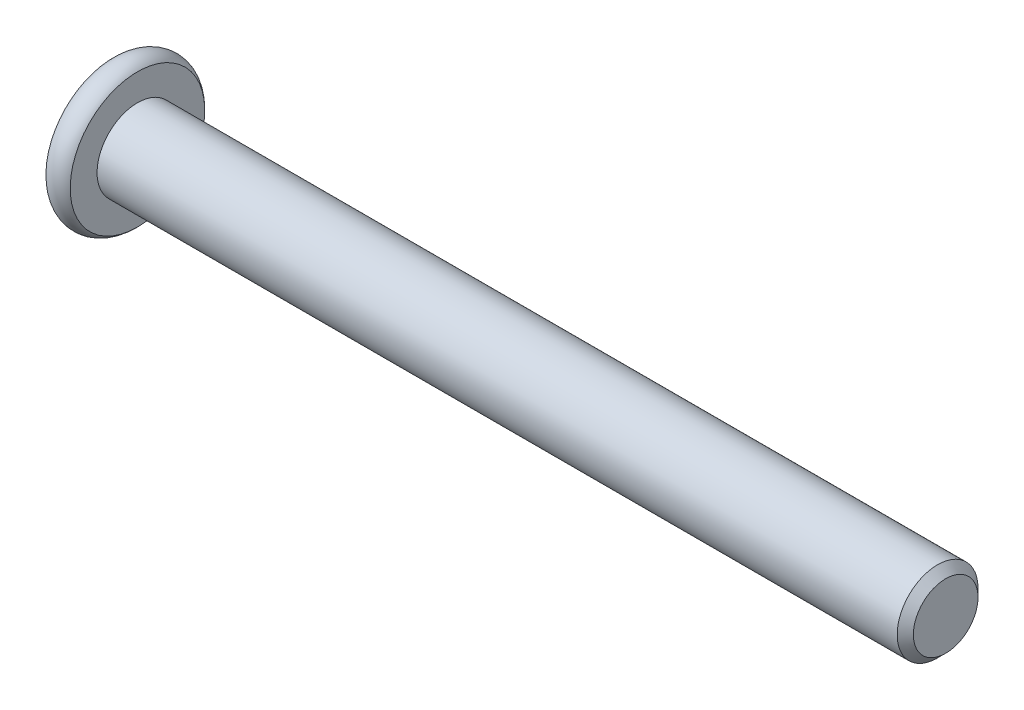
ISO-10303-21;
HEADER;
FILE_DESCRIPTION(('STEP AP214'),'2;1');
FILE_NAME('part.step','',(''),(''),'','','');
FILE_SCHEMA(('AUTOMOTIVE_DESIGN { 1 0 10303 214 1 1 1 1 }'));
ENDSEC;
DATA;
#1=APPLICATION_CONTEXT('core data for automotive mechanical design processes');
#2=APPLICATION_PROTOCOL_DEFINITION('international standard','automotive_design',2000,#1);
#3=PRODUCT_CONTEXT('',#1,'mechanical');
#4=PRODUCT('Part','Part','',(#3));
#5=PRODUCT_RELATED_PRODUCT_CATEGORY('part','',(#4));
#6=PRODUCT_DEFINITION_FORMATION('','',#4);
#7=PRODUCT_DEFINITION_CONTEXT('part definition',#1,'design');
#8=PRODUCT_DEFINITION('design','',#6,#7);
#9=PRODUCT_DEFINITION_SHAPE('','',#8);
#10=(LENGTH_UNIT() NAMED_UNIT(*) SI_UNIT(.MILLI.,.METRE.));
#11=(NAMED_UNIT(*) PLANE_ANGLE_UNIT() SI_UNIT($,.RADIAN.));
#12=(NAMED_UNIT(*) SI_UNIT($,.STERADIAN.) SOLID_ANGLE_UNIT());
#13=UNCERTAINTY_MEASURE_WITH_UNIT(LENGTH_MEASURE(1.E-05),#10,'distance_accuracy_value','');
#14=(GEOMETRIC_REPRESENTATION_CONTEXT(3) GLOBAL_UNCERTAINTY_ASSIGNED_CONTEXT((#13)) GLOBAL_UNIT_ASSIGNED_CONTEXT((#10,
#11,#12)) REPRESENTATION_CONTEXT('',''));
#15=CARTESIAN_POINT('',(0.,0.,0.));
#16=DIRECTION('',(0.,0.,1.));
#17=DIRECTION('',(1.,0.,0.));
#18=AXIS2_PLACEMENT_3D('',#15,#16,#17);
#19=CARTESIAN_POINT('',(-50.,0.,0.));
#20=DIRECTION('',(1.,0.,0.));
#21=DIRECTION('',(0.,0.,-1.));
#22=AXIS2_PLACEMENT_3D('',#19,#20,#21);
#23=CYLINDRICAL_SURFACE('',#22,2.5);
#24=CARTESIAN_POINT('',(-0.500000000000007,0.,0.));
#25=DIRECTION('',(1.,0.,0.));
#26=DIRECTION('',(0.,0.,-1.));
#27=AXIS2_PLACEMENT_3D('',#24,#25,#26);
#28=CIRCLE('',#27,2.5);
#29=CARTESIAN_POINT('',(-0.500000000000007,0.,-2.5));
#30=VERTEX_POINT('',#29);
#31=EDGE_CURVE('E45',#30,#30,#28,.F.);
#32=ORIENTED_EDGE('',*,*,#31,.T.);
#33=EDGE_LOOP('',(#32));
#34=FACE_BOUND('',#33,.T.);
#35=CARTESIAN_POINT('',(-50.,0.,0.));
#36=DIRECTION('',(-1.,0.,0.));
#37=DIRECTION('',(0.,-1.,0.));
#38=AXIS2_PLACEMENT_3D('',#35,#36,#37);
#39=CIRCLE('',#38,2.5);
#40=CARTESIAN_POINT('',(-50.,-2.50000000000001,0.));
#41=VERTEX_POINT('',#40);
#42=EDGE_CURVE('E121',#41,#41,#39,.F.);
#43=ORIENTED_EDGE('',*,*,#42,.T.);
#44=EDGE_LOOP('',(#43));
#45=FACE_BOUND('',#44,.T.);
#46=ADVANCED_FACE('F32',(#34,#45),#23,.T.);
#47=CARTESIAN_POINT('',(0.,0.,0.));
#48=DIRECTION('',(1.,0.,0.));
#49=DIRECTION('',(0.,0.,-1.));
#50=AXIS2_PLACEMENT_3D('',#47,#48,#49);
#51=PLANE('',#50);
#52=CARTESIAN_POINT('',(0.,0.,0.));
#53=DIRECTION('',(1.,0.,0.));
#54=DIRECTION('',(0.,0.,-1.));
#55=AXIS2_PLACEMENT_3D('',#52,#53,#54);
#56=CIRCLE('',#55,1.99999999999999);
#57=CARTESIAN_POINT('',(0.,0.,-1.99999999999999));
#58=VERTEX_POINT('',#57);
#59=EDGE_CURVE('E124',#58,#58,#56,.T.);
#60=ORIENTED_EDGE('',*,*,#59,.T.);
#61=EDGE_LOOP('',(#60));
#62=FACE_BOUND('',#61,.T.);
#63=ADVANCED_FACE('F134',(#62),#51,.T.);
#64=CARTESIAN_POINT('',(0.,0.,0.));
#65=DIRECTION('',(-1.,0.,0.));
#66=DIRECTION('',(0.,0.,1.));
#67=AXIS2_PLACEMENT_3D('',#64,#65,#66);
#68=CONICAL_SURFACE('',#67,1.99999999999999,0.785398163397444);
#69=ORIENTED_EDGE('',*,*,#31,.F.);
#70=EDGE_LOOP('',(#69));
#71=FACE_BOUND('',#70,.T.);
#72=ORIENTED_EDGE('',*,*,#59,.F.);
#73=EDGE_LOOP('',(#72));
#74=FACE_BOUND('',#73,.T.);
#75=ADVANCED_FACE('F34',(#71,#74),#68,.T.);
#76=CARTESIAN_POINT('',(-51.5,0.,0.));
#77=DIRECTION('',(1.,0.,0.));
#78=DIRECTION('',(0.,1.,0.));
#79=AXIS2_PLACEMENT_3D('',#76,#77,#78);
#80=PLANE('',#79);
#81=CARTESIAN_POINT('',(-51.5,1.96613089870591E-13,0.));
#82=DIRECTION('',(-1.,0.,0.));
#83=DIRECTION('',(0.,-1.,0.));
#84=AXIS2_PLACEMENT_3D('',#81,#82,#83);
#85=CIRCLE('',#84,1.78205080756882);
#86=CARTESIAN_POINT('',(-51.5,-1.78205080756862,0.));
#87=VERTEX_POINT('',#86);
#88=EDGE_CURVE('E234',#87,#87,#85,.T.);
#89=ORIENTED_EDGE('',*,*,#88,.F.);
#90=EDGE_LOOP('',(#89));
#91=FACE_BOUND('',#90,.T.);
#92=CARTESIAN_POINT('',(-51.5,0.,0.));
#93=DIRECTION('',(-1.,0.,0.));
#94=DIRECTION('',(0.,-1.,0.));
#95=AXIS2_PLACEMENT_3D('',#92,#93,#94);
#96=CIRCLE('',#95,4.16143782776615);
#97=CARTESIAN_POINT('',(-51.5,-4.16143782776615,0.));
#98=VERTEX_POINT('',#97);
#99=EDGE_CURVE('E118',#98,#98,#96,.T.);
#100=ORIENTED_EDGE('',*,*,#99,.T.);
#101=EDGE_LOOP('',(#100));
#102=FACE_BOUND('',#101,.T.);
#103=ADVANCED_FACE('F133',(#91,#102),#80,.F.);
#104=CARTESIAN_POINT('',(-50.75,0.,0.));
#105=DIRECTION('',(-1.,0.,0.));
#106=DIRECTION('',(0.,-1.,0.));
#107=AXIS2_PLACEMENT_3D('',#104,#105,#106);
#108=TOROIDAL_SURFACE('',#107,3.5,1.);
#109=ORIENTED_EDGE('',*,*,#99,.F.);
#110=EDGE_LOOP('',(#109));
#111=FACE_BOUND('',#110,.T.);
#112=CARTESIAN_POINT('',(-50.,0.,0.));
#113=DIRECTION('',(-1.,0.,0.));
#114=DIRECTION('',(0.,-1.,0.));
#115=AXIS2_PLACEMENT_3D('',#112,#113,#114);
#116=CIRCLE('',#115,4.16143782776615);
#117=CARTESIAN_POINT('',(-50.,-4.16143782776615,0.));
#118=VERTEX_POINT('',#117);
#119=EDGE_CURVE('E115',#118,#118,#116,.T.);
#120=ORIENTED_EDGE('',*,*,#119,.T.);
#121=EDGE_LOOP('',(#120));
#122=FACE_BOUND('',#121,.T.);
#123=ADVANCED_FACE('F145',(#111,#122),#108,.T.);
#124=CARTESIAN_POINT('',(-50.,4.16143782776614,0.));
#125=DIRECTION('',(-1.,0.,0.));
#126=DIRECTION('',(0.,-1.,0.));
#127=AXIS2_PLACEMENT_3D('',#124,#125,#126);
#128=PLANE('',#127);
#129=ORIENTED_EDGE('',*,*,#42,.F.);
#130=EDGE_LOOP('',(#129));
#131=FACE_BOUND('',#130,.T.);
#132=ORIENTED_EDGE('',*,*,#119,.F.);
#133=EDGE_LOOP('',(#132));
#134=FACE_BOUND('',#133,.T.);
#135=ADVANCED_FACE('F149',(#131,#134),#128,.F.);
#136=CARTESIAN_POINT('',(-51.5,1.96613089870591E-13,0.));
#137=DIRECTION('',(-1.,0.,0.));
#138=DIRECTION('',(0.,-1.,0.));
#139=AXIS2_PLACEMENT_3D('',#136,#137,#138);
#140=CONICAL_SURFACE('',#139,1.78205080756882,0.78539816339745);
#141=ORIENTED_EDGE('',*,*,#88,.T.);
#142=EDGE_LOOP('',(#141));
#143=FACE_BOUND('',#142,.T.);
#144=CARTESIAN_POINT('',(-52.015428085613,-1.74023253176558,1.5));
#145=CARTESIAN_POINT('',(-51.9833811073445,-1.69791724929712,1.5));
#146=CARTESIAN_POINT('',(-51.9516444672841,-1.65536760966773,1.5));
#147=CARTESIAN_POINT('',(-51.8889203936153,-1.56970398156666,1.5));
#148=CARTESIAN_POINT('',(-51.85793314822,-1.5265898554283,1.5));
#149=CARTESIAN_POINT('',(-51.765846164345,-1.39562626326545,1.5));
#150=CARTESIAN_POINT('',(-51.7061145123022,-1.30679868010557,1.5));
#151=CARTESIAN_POINT('',(-51.5887342891013,-1.12044622640197,1.5));
#152=CARTESIAN_POINT('',(-51.5314082774823,-1.02271587306654,1.5));
#153=CARTESIAN_POINT('',(-51.426463214976,-0.822357214965081,1.5));
#154=CARTESIAN_POINT('',(-51.3788114236897,-0.719746931701749,1.5));
#155=CARTESIAN_POINT('',(-51.3205099883151,-0.565852387094925,1.5));
#156=CARTESIAN_POINT('',(-51.303799053541,-0.516874191424513,1.5));
#157=CARTESIAN_POINT('',(-51.2743077515089,-0.417723988457352,1.5));
#158=CARTESIAN_POINT('',(-51.261527651422,-0.367551900263719,1.5));
#159=CARTESIAN_POINT('',(-51.2407784202458,-0.267158299055971,1.5));
#160=CARTESIAN_POINT('',(-51.232726061826,-0.216954261864707,1.5));
#161=CARTESIAN_POINT('',(-51.2215916368341,-0.115994915871174,1.5));
#162=CARTESIAN_POINT('',(-51.2185086886377,-0.0652397064613918,1.5));
#163=CARTESIAN_POINT('',(-51.2175473897404,0.0344222234877031,1.5));
#164=CARTESIAN_POINT('',(-51.2194789216952,0.0833271701102367,1.5));
#165=CARTESIAN_POINT('',(-51.2280175729677,0.180724293127368,1.5));
#166=CARTESIAN_POINT('',(-51.2346251420481,0.229216429361875,1.5));
#167=CARTESIAN_POINT('',(-51.2522650626447,0.326258027697153,1.5));
#168=CARTESIAN_POINT('',(-51.263373168201,0.374793507450172,1.5));
#169=CARTESIAN_POINT('',(-51.2894198669596,0.470802295834325,1.5));
#170=CARTESIAN_POINT('',(-51.3043581560036,0.518275688481428,1.5));
#171=CARTESIAN_POINT('',(-51.356839545716,0.667150562065279,1.5));
#172=CARTESIAN_POINT('',(-51.4003351165442,0.766448362426999,1.5));
#173=CARTESIAN_POINT('',(-51.4970587814837,0.960384405673988,1.5));
#174=CARTESIAN_POINT('',(-51.5503217226675,1.05500437383636,1.5));
#175=CARTESIAN_POINT('',(-51.6602258010454,1.23584520321547,1.5));
#176=CARTESIAN_POINT('',(-51.7165682531047,1.32224986946565,1.5));
#177=CARTESIAN_POINT('',(-51.8036755725971,1.44954953726489,1.5));
#178=CARTESIAN_POINT('',(-51.8330199906839,1.49143368482439,1.5));
#179=CARTESIAN_POINT('',(-51.8924869182931,1.5746291478326,1.5));
#180=CARTESIAN_POINT('',(-51.9226092115008,1.61594061772595,1.5));
#181=CARTESIAN_POINT('',(-51.9530541181366,1.65701358742569,1.5));
#182=B_SPLINE_CURVE_WITH_KNOTS('',3,(#144,#145,#146,#147,#148,#149,#150,#151,#152,#153,#154,
#155,#156,#157,#158,#159,#160,#161,#162,#163,#164,#165,#166,#167,#168,#169,#170,#171,#172,#173,
#174,#175,#176,#177,#178,#179,#180,#181),.UNSPECIFIED.,.F.,.F.,(4,2,2,2,2,2,2,2,2,2,2,2,2,2,2,2,
2,2,4),(0.,0.159238974218347,0.318517535014538,0.639504781932377,0.979137893799178,
1.31760168934354,1.47272233841621,1.62785352839772,1.78016486537343,1.93244917778275,
2.07904486260294,2.22565464958328,2.37484213303395,2.52401777304035,2.84828365283771,
3.17372975666746,3.48303030530534,3.63644667013904,3.78982082222909),.UNSPECIFIED.);
#183=CARTESIAN_POINT('',(-51.4500000000001,-0.866025403784243,1.5));
#184=VERTEX_POINT('',#183);
#185=CARTESIAN_POINT('',(-51.4500000000001,0.866025403784635,1.5));
#186=VERTEX_POINT('',#185);
#187=EDGE_CURVE('E99',#184,#186,#182,.T.);
#188=ORIENTED_EDGE('',*,*,#187,.F.);
#189=CARTESIAN_POINT('',(-51.4501154816001,-1.73216627762252,-0.000199999999999745));
#190=CARTESIAN_POINT('',(-51.4203654760674,-1.70239359975895,0.0513677907370769));
#191=CARTESIAN_POINT('',(-51.3923624839104,-1.67212305186335,0.103797917665202));
#192=CARTESIAN_POINT('',(-51.3410892304402,-1.61039789003599,0.210709034055598));
#193=CARTESIAN_POINT('',(-51.3178475050444,-1.57893740312594,0.265200195814662));
#194=CARTESIAN_POINT('',(-51.2780337289923,-1.51549879897968,0.375079081357249));
#195=CARTESIAN_POINT('',(-51.261361585671,-1.48353684526791,0.4304388090952));
#196=CARTESIAN_POINT('',(-51.2356744568182,-1.41890915196192,0.54237725747715));
#197=CARTESIAN_POINT('',(-51.2266402904789,-1.38624538781099,0.598952556553008));
#198=CARTESIAN_POINT('',(-51.2184890812269,-1.3299521009528,0.696455389516441));
#199=CARTESIAN_POINT('',(-51.2172822529893,-1.30639533311104,0.737256908280466));
#200=CARTESIAN_POINT('',(-51.2193140571623,-1.25932335290174,0.818787969615858));
#201=CARTESIAN_POINT('',(-51.2225536707484,-1.23580815085294,0.85951749431463));
#202=CARTESIAN_POINT('',(-51.233291985982,-1.18900414978407,0.940584402163416));
#203=CARTESIAN_POINT('',(-51.2407946530188,-1.165715582117,0.980921384598288));
#204=CARTESIAN_POINT('',(-51.2596516119284,-1.11952932016316,1.06091833691403));
#205=CARTESIAN_POINT('',(-51.2710075570187,-1.09663179808767,1.10057800851621));
#206=CARTESIAN_POINT('',(-51.3047216475927,-1.03798159809679,1.20216313477448));
#207=CARTESIAN_POINT('',(-51.3296218490934,-1.00259267147446,1.26345855370969));
#208=CARTESIAN_POINT('',(-51.3716566532716,-0.950557780604179,1.35358562846331));
#209=CARTESIAN_POINT('',(-51.3864251535592,-0.933410759676951,1.38328513990772));
#210=CARTESIAN_POINT('',(-51.4173105659402,-0.89943210199621,1.44213790138375));
#211=CARTESIAN_POINT('',(-51.4334268341218,-0.882600319285514,1.47129140422064));
#212=CARTESIAN_POINT('',(-51.4501154816001,-0.865909933730405,1.5002));
#213=B_SPLINE_CURVE_WITH_KNOTS('',3,(#189,#190,#191,#192,#193,#194,#195,#196,#197,#198,#199,
#200,#201,#202,#203,#204,#205,#206,#207,#208,#209,#210,#211,#212),.UNSPECIFIED.,.F.,.F.,(4,2,2,
2,2,2,2,2,2,2,2,4),(0.,0.199829143693305,0.40082298738239,0.59862372053818,0.795926240188888,
0.93711306795988,1.07833105577193,1.21968061668222,1.36109089931054,1.58570969637565,
1.69770705470963,1.80965120737193),.UNSPECIFIED.);
#214=CARTESIAN_POINT('',(-51.4500000000001,-1.73205080756868,0.));
#215=VERTEX_POINT('',#214);
#216=EDGE_CURVE('E191',#215,#184,#213,.T.);
#217=ORIENTED_EDGE('',*,*,#216,.F.);
#218=CARTESIAN_POINT('',(-51.4501154816001,-0.865909933730404,-1.5002));
#219=CARTESIAN_POINT('',(-51.4203654760674,-0.895682611593969,-1.44863220926292));
#220=CARTESIAN_POINT('',(-51.3923624839104,-0.925953159489568,-1.3962020823348));
#221=CARTESIAN_POINT('',(-51.3410892304402,-0.987678321316926,-1.2892909659444));
#222=CARTESIAN_POINT('',(-51.3178475050444,-1.01913880822698,-1.23479980418534));
#223=CARTESIAN_POINT('',(-51.2780337289923,-1.08257741237325,-1.12492091864275));
#224=CARTESIAN_POINT('',(-51.261361585671,-1.11453936608502,-1.0695611909048));
#225=CARTESIAN_POINT('',(-51.2356744568182,-1.179167059391,-0.957622742522854));
#226=CARTESIAN_POINT('',(-51.2266402904789,-1.21183082354193,-0.901047443446996));
#227=CARTESIAN_POINT('',(-51.2184890812269,-1.26812411040012,-0.803544610483565));
#228=CARTESIAN_POINT('',(-51.2172822529893,-1.29168087824188,-0.762743091719539));
#229=CARTESIAN_POINT('',(-51.2193140571623,-1.33875285845118,-0.681212030384147));
#230=CARTESIAN_POINT('',(-51.2225536707484,-1.36226806049998,-0.640482505685375));
#231=CARTESIAN_POINT('',(-51.233291985982,-1.40907206156885,-0.559415597836589));
#232=CARTESIAN_POINT('',(-51.2407946530188,-1.43236062923592,-0.519078615401717));
#233=CARTESIAN_POINT('',(-51.2596516119284,-1.47854689118977,-0.439081663085975));
#234=CARTESIAN_POINT('',(-51.2710075570187,-1.50144441326525,-0.399421991483799));
#235=CARTESIAN_POINT('',(-51.3047216475927,-1.56009461325613,-0.297836865225521));
#236=CARTESIAN_POINT('',(-51.3296218490934,-1.59548353987846,-0.236541446290316));
#237=CARTESIAN_POINT('',(-51.3716566532716,-1.64751843074874,-0.14641437153669));
#238=CARTESIAN_POINT('',(-51.3864251535592,-1.66466545167597,-0.116714860092286));
#239=CARTESIAN_POINT('',(-51.4173105659402,-1.69864410935671,-0.0578620986162516));
#240=CARTESIAN_POINT('',(-51.4334268341218,-1.71547589206741,-0.028708595779365));
#241=CARTESIAN_POINT('',(-51.4501154816001,-1.73216627762252,0.000199999999999504));
#242=B_SPLINE_CURVE_WITH_KNOTS('',3,(#218,#219,#220,#221,#222,#223,#224,#225,#226,#227,#228,
#229,#230,#231,#232,#233,#234,#235,#236,#237,#238,#239,#240,#241),.UNSPECIFIED.,.F.,.F.,(4,2,2,
2,2,2,2,2,2,2,2,4),(0.,0.199829143693303,0.400822987382387,0.598623720538177,0.795926240188884,
0.937113067959876,1.07833105577192,1.21968061668221,1.36109089931054,1.58570969637565,
1.69770705470963,1.80965120737194),.UNSPECIFIED.);
#243=CARTESIAN_POINT('',(-51.4500000000001,-0.866025403784242,-1.5));
#244=VERTEX_POINT('',#243);
#245=EDGE_CURVE('E186',#244,#215,#242,.T.);
#246=ORIENTED_EDGE('',*,*,#245,.F.);
#247=CARTESIAN_POINT('',(-52.015428085613,-1.74023253176558,-1.5));
#248=CARTESIAN_POINT('',(-51.9833811073445,-1.69791724929712,-1.5));
#249=CARTESIAN_POINT('',(-51.9516444672841,-1.65536760966773,-1.5));
#250=CARTESIAN_POINT('',(-51.8889203936153,-1.56970398156666,-1.5));
#251=CARTESIAN_POINT('',(-51.85793314822,-1.5265898554283,-1.5));
#252=CARTESIAN_POINT('',(-51.765846164345,-1.39562626326545,-1.5));
#253=CARTESIAN_POINT('',(-51.7061145123022,-1.30679868010557,-1.5));
#254=CARTESIAN_POINT('',(-51.5887342891013,-1.12044622640197,-1.5));
#255=CARTESIAN_POINT('',(-51.5314082774823,-1.02271587306655,-1.5));
#256=CARTESIAN_POINT('',(-51.426463214976,-0.822357214965083,-1.5));
#257=CARTESIAN_POINT('',(-51.3788114236897,-0.719746931701749,-1.5));
#258=CARTESIAN_POINT('',(-51.3205099883151,-0.565852387094925,-1.5));
#259=CARTESIAN_POINT('',(-51.303799053541,-0.516874191424513,-1.5));
#260=CARTESIAN_POINT('',(-51.2743077515089,-0.417723988457353,-1.5));
#261=CARTESIAN_POINT('',(-51.261527651422,-0.367551900263721,-1.5));
#262=CARTESIAN_POINT('',(-51.2407784202458,-0.267158299055973,-1.5));
#263=CARTESIAN_POINT('',(-51.232726061826,-0.216954261864709,-1.5));
#264=CARTESIAN_POINT('',(-51.2215916368341,-0.115994915871175,-1.5));
#265=CARTESIAN_POINT('',(-51.2185086886377,-0.0652397064613931,-1.5));
#266=CARTESIAN_POINT('',(-51.2175473897404,0.0344222234877014,-1.5));
#267=CARTESIAN_POINT('',(-51.2194789216952,0.0833271701102342,-1.5));
#268=CARTESIAN_POINT('',(-51.2280175729677,0.180724293127366,-1.5));
#269=CARTESIAN_POINT('',(-51.2346251420481,0.229216429361873,-1.5));
#270=CARTESIAN_POINT('',(-51.2522650626447,0.326258027697151,-1.5));
#271=CARTESIAN_POINT('',(-51.263373168201,0.37479350745017,-1.5));
#272=CARTESIAN_POINT('',(-51.2894198669596,0.470802295834323,-1.5));
#273=CARTESIAN_POINT('',(-51.3043581560036,0.518275688481427,-1.5));
#274=CARTESIAN_POINT('',(-51.356839545716,0.667150562065277,-1.5));
#275=CARTESIAN_POINT('',(-51.4003351165442,0.766448362426997,-1.5));
#276=CARTESIAN_POINT('',(-51.4970587814837,0.960384405673985,-1.5));
#277=CARTESIAN_POINT('',(-51.5503217226675,1.05500437383636,-1.5));
#278=CARTESIAN_POINT('',(-51.6602258010454,1.23584520321547,-1.5));
#279=CARTESIAN_POINT('',(-51.7165682531047,1.32224986946565,-1.5));
#280=CARTESIAN_POINT('',(-51.8036755725971,1.44954953726488,-1.5));
#281=CARTESIAN_POINT('',(-51.8330199906839,1.49143368482438,-1.5));
#282=CARTESIAN_POINT('',(-51.8924869182931,1.57462914783259,-1.5));
#283=CARTESIAN_POINT('',(-51.9226092115008,1.61594061772594,-1.5));
#284=CARTESIAN_POINT('',(-51.9530541181366,1.65701358742568,-1.5));
#285=B_SPLINE_CURVE_WITH_KNOTS('',3,(#247,#248,#249,#250,#251,#252,#253,#254,#255,#256,#257,
#258,#259,#260,#261,#262,#263,#264,#265,#266,#267,#268,#269,#270,#271,#272,#273,#274,#275,#276,
#277,#278,#279,#280,#281,#282,#283,#284),.UNSPECIFIED.,.F.,.F.,(4,2,2,2,2,2,2,2,2,2,2,2,2,2,2,2,
2,2,4),(0.,0.159238974218348,0.318517535014539,0.639504781932378,0.979137893799177,
1.31760168934354,1.47272233841621,1.62785352839772,1.78016486537343,1.93244917778275,
2.07904486260293,2.22565464958328,2.37484213303394,2.52401777304035,2.84828365283771,
3.17372975666746,3.48303030530533,3.63644667013904,3.78982082222909),.UNSPECIFIED.);
#286=CARTESIAN_POINT('',(-51.4500000000001,0.866025403784635,-1.5));
#287=VERTEX_POINT('',#286);
#288=EDGE_CURVE('E52',#287,#244,#285,.F.);
#289=ORIENTED_EDGE('',*,*,#288,.F.);
#290=CARTESIAN_POINT('',(-51.4501154816001,1.73216627762291,0.000200000000001458));
#291=CARTESIAN_POINT('',(-51.4203654760674,1.70239359975935,-0.0513677907370729));
#292=CARTESIAN_POINT('',(-51.3923624839104,1.67212305186375,-0.103797917665198));
#293=CARTESIAN_POINT('',(-51.3410892304402,1.61039789003639,-0.210709034055595));
#294=CARTESIAN_POINT('',(-51.3178475050444,1.57893740312634,-0.26520019581466));
#295=CARTESIAN_POINT('',(-51.2780337289923,1.51549879898007,-0.375079081357248));
#296=CARTESIAN_POINT('',(-51.261361585671,1.4835368452683,-0.430438809095198));
#297=CARTESIAN_POINT('',(-51.2356744568182,1.41890915196231,-0.542377257477149));
#298=CARTESIAN_POINT('',(-51.2266402904789,1.38624538781138,-0.598952556553006));
#299=CARTESIAN_POINT('',(-51.2184890812269,1.32995210095319,-0.696455389516438));
#300=CARTESIAN_POINT('',(-51.2172822529893,1.30639533311144,-0.737256908280463));
#301=CARTESIAN_POINT('',(-51.2193140571623,1.25932335290213,-0.818787969615855));
#302=CARTESIAN_POINT('',(-51.2225536707484,1.23580815085333,-0.859517494314627));
#303=CARTESIAN_POINT('',(-51.233291985982,1.18900414978446,-0.940584402163414));
#304=CARTESIAN_POINT('',(-51.2407946530188,1.16571558211739,-0.980921384598286));
#305=CARTESIAN_POINT('',(-51.2596516119284,1.11952932016355,-1.06091833691403));
#306=CARTESIAN_POINT('',(-51.2710075570186,1.09663179808806,-1.10057800851621));
#307=CARTESIAN_POINT('',(-51.3047216475927,1.03798159809718,-1.20216313477448));
#308=CARTESIAN_POINT('',(-51.3296218490934,1.00259267147485,-1.26345855370969));
#309=CARTESIAN_POINT('',(-51.3716566532716,0.950557780604572,-1.35358562846331));
#310=CARTESIAN_POINT('',(-51.3864251535592,0.933410759677345,-1.38328513990772));
#311=CARTESIAN_POINT('',(-51.4173105659402,0.899432101996604,-1.44213790138375));
#312=CARTESIAN_POINT('',(-51.4334268341218,0.882600319285907,-1.47129140422064));
#313=CARTESIAN_POINT('',(-51.4501154816001,0.865909933730798,-1.5002));
#314=B_SPLINE_CURVE_WITH_KNOTS('',3,(#290,#291,#292,#293,#294,#295,#296,#297,#298,#299,#300,
#301,#302,#303,#304,#305,#306,#307,#308,#309,#310,#311,#312,#313),.UNSPECIFIED.,.F.,.F.,(4,2,2,
2,2,2,2,2,2,2,2,4),(0.,0.199829143693306,0.40082298738239,0.598623720538182,0.795926240188889,
0.937113067959881,1.07833105577193,1.21968061668222,1.36109089931054,1.58570969637566,
1.69770705470964,1.80965120737194),.UNSPECIFIED.);
#315=CARTESIAN_POINT('',(-51.4500000000001,1.73205080756907,0.));
#316=VERTEX_POINT('',#315);
#317=EDGE_CURVE('E11',#316,#287,#314,.T.);
#318=ORIENTED_EDGE('',*,*,#317,.F.);
#319=CARTESIAN_POINT('',(-51.4501154816001,0.865909933730798,1.5002));
#320=CARTESIAN_POINT('',(-51.4203654760674,0.895682611594362,1.44863220926292));
#321=CARTESIAN_POINT('',(-51.3923624839104,0.925953159489961,1.3962020823348));
#322=CARTESIAN_POINT('',(-51.3410892304402,0.987678321317318,1.28929096594441));
#323=CARTESIAN_POINT('',(-51.3178475050444,1.01913880822737,1.23479980418534));
#324=CARTESIAN_POINT('',(-51.2780337289923,1.08257741237364,1.12492091864275));
#325=CARTESIAN_POINT('',(-51.261361585671,1.11453936608541,1.0695611909048));
#326=CARTESIAN_POINT('',(-51.2356744568182,1.1791670593914,0.957622742522851));
#327=CARTESIAN_POINT('',(-51.2266402904789,1.21183082354233,0.901047443446994));
#328=CARTESIAN_POINT('',(-51.2184890812269,1.26812411040052,0.803544610483562));
#329=CARTESIAN_POINT('',(-51.2172822529893,1.29168087824227,0.762743091719537));
#330=CARTESIAN_POINT('',(-51.2193140571623,1.33875285845158,0.681212030384145));
#331=CARTESIAN_POINT('',(-51.2225536707484,1.36226806050038,0.640482505685373));
#332=CARTESIAN_POINT('',(-51.233291985982,1.40907206156924,0.559415597836587));
#333=CARTESIAN_POINT('',(-51.2407946530188,1.43236062923631,0.519078615401715));
#334=CARTESIAN_POINT('',(-51.2596516119283,1.47854689119016,0.439081663085972));
#335=CARTESIAN_POINT('',(-51.2710075570186,1.50144441326565,0.399421991483795));
#336=CARTESIAN_POINT('',(-51.3047216475927,1.56009461325653,0.297836865225517));
#337=CARTESIAN_POINT('',(-51.3296218490934,1.59548353987886,0.236541446290312));
#338=CARTESIAN_POINT('',(-51.3716566532716,1.64751843074914,0.146414371536687));
#339=CARTESIAN_POINT('',(-51.3864251535592,1.66466545167637,0.116714860092282));
#340=CARTESIAN_POINT('',(-51.4173105659402,1.69864410935711,0.0578620986162484));
#341=CARTESIAN_POINT('',(-51.4334268341218,1.7154758920678,0.0287085957793615));
#342=CARTESIAN_POINT('',(-51.4501154816001,1.73216627762291,-0.000200000000001557));
#343=B_SPLINE_CURVE_WITH_KNOTS('',3,(#319,#320,#321,#322,#323,#324,#325,#326,#327,#328,#329,
#330,#331,#332,#333,#334,#335,#336,#337,#338,#339,#340,#341,#342),.UNSPECIFIED.,.F.,.F.,(4,2,2,
2,2,2,2,2,2,2,2,4),(0.,0.199829143693301,0.400822987382387,0.598623720538178,0.795926240188886,
0.937113067959877,1.07833105577192,1.21968061668221,1.36109089931054,1.58570969637565,
1.69770705470964,1.80965120737194),.UNSPECIFIED.);
#344=EDGE_CURVE('E90',#186,#316,#343,.T.);
#345=ORIENTED_EDGE('',*,*,#344,.F.);
#346=EDGE_LOOP('',(#188,#217,#246,#289,#318,#345));
#347=FACE_BOUND('',#346,.T.);
#348=ADVANCED_FACE('F89',(#143,#347),#140,.F.);
#349=CARTESIAN_POINT('',(-49.2,4.03854964348887E-13,0.));
#350=DIRECTION('',(-1.,0.,0.));
#351=DIRECTION('',(0.,-1.,0.));
#352=AXIS2_PLACEMENT_3D('',#349,#350,#351);
#353=PLANE('',#352);
#354=DIRECTION('',(0.,0.5,-0.866025403784438));
#355=VECTOR('',#354,1.);
#356=CARTESIAN_POINT('',(-49.2,0.866025403784627,1.5));
#357=LINE('',#356,#355);
#358=CARTESIAN_POINT('',(-49.2,0.866025403784627,1.5));
#359=VERTEX_POINT('',#358);
#360=CARTESIAN_POINT('',(-49.2,1.73205080756907,0.));
#361=VERTEX_POINT('',#360);
#362=EDGE_CURVE('E98',#359,#361,#357,.T.);
#363=ORIENTED_EDGE('',*,*,#362,.T.);
#364=DIRECTION('',(0.,-0.5,-0.866025403784439));
#365=VECTOR('',#364,1.);
#366=CARTESIAN_POINT('',(-49.2,1.73205080756907,0.));
#367=LINE('',#366,#365);
#368=CARTESIAN_POINT('',(-49.2,0.866025403784627,-1.5));
#369=VERTEX_POINT('',#368);
#370=EDGE_CURVE('E103',#361,#369,#367,.T.);
#371=ORIENTED_EDGE('',*,*,#370,.T.);
#372=DIRECTION('',(0.,-1.,0.));
#373=VECTOR('',#372,1.);
#374=CARTESIAN_POINT('',(-49.2,0.866025403784627,-1.5));
#375=LINE('',#374,#373);
#376=CARTESIAN_POINT('',(-49.2,-0.86602540378425,-1.5));
#377=VERTEX_POINT('',#376);
#378=EDGE_CURVE('E216',#369,#377,#375,.T.);
#379=ORIENTED_EDGE('',*,*,#378,.T.);
#380=DIRECTION('',(0.,-0.5,0.866025403784438));
#381=VECTOR('',#380,1.);
#382=CARTESIAN_POINT('',(-49.2,-0.86602540378425,-1.5));
#383=LINE('',#382,#381);
#384=CARTESIAN_POINT('',(-49.2,-1.73205080756869,0.));
#385=VERTEX_POINT('',#384);
#386=EDGE_CURVE('E220',#377,#385,#383,.T.);
#387=ORIENTED_EDGE('',*,*,#386,.T.);
#388=DIRECTION('',(0.,0.5,0.866025403784439));
#389=VECTOR('',#388,1.);
#390=CARTESIAN_POINT('',(-49.2,-1.73205080756869,0.));
#391=LINE('',#390,#389);
#392=CARTESIAN_POINT('',(-49.2,-0.866025403784251,1.5));
#393=VERTEX_POINT('',#392);
#394=EDGE_CURVE('E111',#385,#393,#391,.T.);
#395=ORIENTED_EDGE('',*,*,#394,.T.);
#396=DIRECTION('',(0.,1.,0.));
#397=VECTOR('',#396,1.);
#398=CARTESIAN_POINT('',(-49.2,-0.866025403784251,1.5));
#399=LINE('',#398,#397);
#400=EDGE_CURVE('E106',#393,#359,#399,.T.);
#401=ORIENTED_EDGE('',*,*,#400,.T.);
#402=EDGE_LOOP('',(#363,#371,#379,#387,#395,#401));
#403=FACE_BOUND('',#402,.T.);
#404=ADVANCED_FACE('F173',(#403),#353,.T.);
#405=CARTESIAN_POINT('',(-49.2,1.73205080756907,0.));
#406=DIRECTION('',(0.,0.866025403784439,-0.5));
#407=DIRECTION('',(0.,0.5,0.866025403784439));
#408=AXIS2_PLACEMENT_3D('',#405,#406,#407);
#409=PLANE('',#408);
#410=DIRECTION('',(-1.,0.,0.));
#411=VECTOR('',#410,1.);
#412=CARTESIAN_POINT('',(-49.2,1.73205080756907,0.));
#413=LINE('',#412,#411);
#414=EDGE_CURVE('E96',#361,#316,#413,.T.);
#415=ORIENTED_EDGE('',*,*,#414,.T.);
#416=ORIENTED_EDGE('',*,*,#317,.T.);
#417=DIRECTION('',(-1.,0.,0.));
#418=VECTOR('',#417,1.);
#419=CARTESIAN_POINT('',(-49.2,0.866025403784627,-1.5));
#420=LINE('',#419,#418);
#421=EDGE_CURVE('E105',#369,#287,#420,.T.);
#422=ORIENTED_EDGE('',*,*,#421,.F.);
#423=ORIENTED_EDGE('',*,*,#370,.F.);
#424=EDGE_LOOP('',(#415,#416,#422,#423));
#425=FACE_BOUND('',#424,.T.);
#426=ADVANCED_FACE('F101',(#425),#409,.F.);
#427=CARTESIAN_POINT('',(-49.2,0.866025403784627,-1.5));
#428=DIRECTION('',(0.,0.,-1.));
#429=DIRECTION('',(-1.,0.,0.));
#430=AXIS2_PLACEMENT_3D('',#427,#428,#429);
#431=PLANE('',#430);
#432=ORIENTED_EDGE('',*,*,#421,.T.);
#433=ORIENTED_EDGE('',*,*,#288,.T.);
#434=DIRECTION('',(-1.,0.,0.));
#435=VECTOR('',#434,1.);
#436=CARTESIAN_POINT('',(-49.2,-0.86602540378425,-1.5));
#437=LINE('',#436,#435);
#438=EDGE_CURVE('E108',#377,#244,#437,.T.);
#439=ORIENTED_EDGE('',*,*,#438,.F.);
#440=ORIENTED_EDGE('',*,*,#378,.F.);
#441=EDGE_LOOP('',(#432,#433,#439,#440));
#442=FACE_BOUND('',#441,.T.);
#443=ADVANCED_FACE('F205',(#442),#431,.F.);
#444=CARTESIAN_POINT('',(-49.2,-0.86602540378425,-1.5));
#445=DIRECTION('',(0.,-0.866025403784439,-0.5));
#446=DIRECTION('',(0.,0.5,-0.866025403784439));
#447=AXIS2_PLACEMENT_3D('',#444,#445,#446);
#448=PLANE('',#447);
#449=ORIENTED_EDGE('',*,*,#438,.T.);
#450=ORIENTED_EDGE('',*,*,#245,.T.);
#451=DIRECTION('',(-1.,0.,0.));
#452=VECTOR('',#451,1.);
#453=CARTESIAN_POINT('',(-49.2,-1.73205080756869,0.));
#454=LINE('',#453,#452);
#455=EDGE_CURVE('E230',#385,#215,#454,.T.);
#456=ORIENTED_EDGE('',*,*,#455,.F.);
#457=ORIENTED_EDGE('',*,*,#386,.F.);
#458=EDGE_LOOP('',(#449,#450,#456,#457));
#459=FACE_BOUND('',#458,.T.);
#460=ADVANCED_FACE('F200',(#459),#448,.F.);
#461=CARTESIAN_POINT('',(-49.2,-1.73205080756869,0.));
#462=DIRECTION('',(0.,-0.866025403784439,0.5));
#463=DIRECTION('',(0.,-0.5,-0.866025403784439));
#464=AXIS2_PLACEMENT_3D('',#461,#462,#463);
#465=PLANE('',#464);
#466=ORIENTED_EDGE('',*,*,#455,.T.);
#467=ORIENTED_EDGE('',*,*,#216,.T.);
#468=DIRECTION('',(-1.,0.,0.));
#469=VECTOR('',#468,1.);
#470=CARTESIAN_POINT('',(-49.2,-0.866025403784251,1.5));
#471=LINE('',#470,#469);
#472=EDGE_CURVE('E227',#393,#184,#471,.T.);
#473=ORIENTED_EDGE('',*,*,#472,.F.);
#474=ORIENTED_EDGE('',*,*,#394,.F.);
#475=EDGE_LOOP('',(#466,#467,#473,#474));
#476=FACE_BOUND('',#475,.T.);
#477=ADVANCED_FACE('F197',(#476),#465,.F.);
#478=CARTESIAN_POINT('',(-49.2,-0.866025403784251,1.5));
#479=DIRECTION('',(0.,0.,1.));
#480=DIRECTION('',(1.,0.,0.));
#481=AXIS2_PLACEMENT_3D('',#478,#479,#480);
#482=PLANE('',#481);
#483=ORIENTED_EDGE('',*,*,#472,.T.);
#484=ORIENTED_EDGE('',*,*,#187,.T.);
#485=DIRECTION('',(-1.,0.,0.));
#486=VECTOR('',#485,1.);
#487=CARTESIAN_POINT('',(-49.2,0.866025403784627,1.5));
#488=LINE('',#487,#486);
#489=EDGE_CURVE('E59',#359,#186,#488,.T.);
#490=ORIENTED_EDGE('',*,*,#489,.F.);
#491=ORIENTED_EDGE('',*,*,#400,.F.);
#492=EDGE_LOOP('',(#483,#484,#490,#491));
#493=FACE_BOUND('',#492,.T.);
#494=ADVANCED_FACE('F156',(#493),#482,.F.);
#495=CARTESIAN_POINT('',(-49.2,0.866025403784627,1.5));
#496=DIRECTION('',(0.,0.866025403784439,0.5));
#497=DIRECTION('',(0.,-0.5,0.866025403784439));
#498=AXIS2_PLACEMENT_3D('',#495,#496,#497);
#499=PLANE('',#498);
#500=ORIENTED_EDGE('',*,*,#489,.T.);
#501=ORIENTED_EDGE('',*,*,#344,.T.);
#502=ORIENTED_EDGE('',*,*,#414,.F.);
#503=ORIENTED_EDGE('',*,*,#362,.F.);
#504=EDGE_LOOP('',(#500,#501,#502,#503));
#505=FACE_BOUND('',#504,.T.);
#506=ADVANCED_FACE('F95',(#505),#499,.F.);
#507=CLOSED_SHELL('',(#46,#63,#75,#103,#123,#135,#348,#404,#426,#443,#460,#477,#494,#506));
#508=MANIFOLD_SOLID_BREP('B2',#507);
#509=ADVANCED_BREP_SHAPE_REPRESENTATION('',(#18,#508),#14);
#510=SHAPE_DEFINITION_REPRESENTATION(#9,#509);
ENDSEC;
END-ISO-10303-21;
